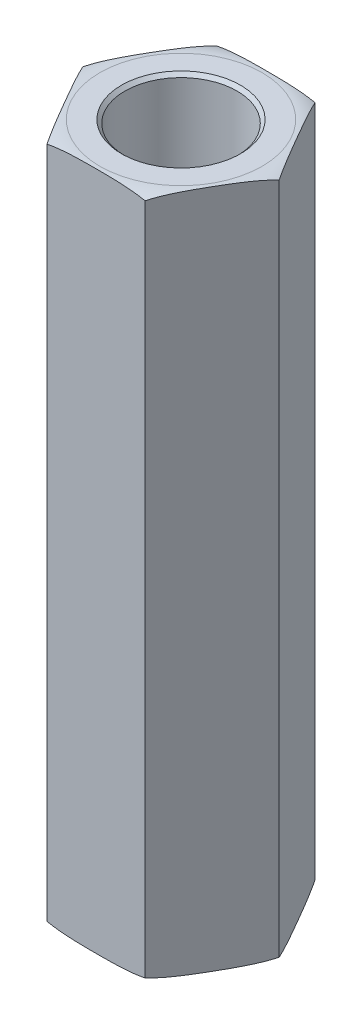
ISO-10303-21;
HEADER;
FILE_DESCRIPTION(('STEP AP214'),'2;1');
FILE_NAME('part.step','',(''),(''),'','','');
FILE_SCHEMA(('AUTOMOTIVE_DESIGN { 1 0 10303 214 1 1 1 1 }'));
ENDSEC;
DATA;
#1=APPLICATION_CONTEXT('core data for automotive mechanical design processes');
#2=APPLICATION_PROTOCOL_DEFINITION('international standard','automotive_design',2000,#1);
#3=PRODUCT_CONTEXT('',#1,'mechanical');
#4=PRODUCT('Part','Part','',(#3));
#5=PRODUCT_RELATED_PRODUCT_CATEGORY('part','',(#4));
#6=PRODUCT_DEFINITION_FORMATION('','',#4);
#7=PRODUCT_DEFINITION_CONTEXT('part definition',#1,'design');
#8=PRODUCT_DEFINITION('design','',#6,#7);
#9=PRODUCT_DEFINITION_SHAPE('','',#8);
#10=(LENGTH_UNIT() NAMED_UNIT(*) SI_UNIT(.MILLI.,.METRE.));
#11=(NAMED_UNIT(*) PLANE_ANGLE_UNIT() SI_UNIT($,.RADIAN.));
#12=(NAMED_UNIT(*) SI_UNIT($,.STERADIAN.) SOLID_ANGLE_UNIT());
#13=UNCERTAINTY_MEASURE_WITH_UNIT(LENGTH_MEASURE(1.E-05),#10,'distance_accuracy_value','');
#14=(GEOMETRIC_REPRESENTATION_CONTEXT(3) GLOBAL_UNCERTAINTY_ASSIGNED_CONTEXT((#13)) GLOBAL_UNIT_ASSIGNED_CONTEXT((#10,
#11,#12)) REPRESENTATION_CONTEXT('',''));
#15=CARTESIAN_POINT('',(0.,0.,0.));
#16=DIRECTION('',(0.,0.,1.));
#17=DIRECTION('',(1.,0.,0.));
#18=AXIS2_PLACEMENT_3D('',#15,#16,#17);
#19=CARTESIAN_POINT('',(3.66617420935412,12.7,0.));
#20=DIRECTION('',(-0.866025403784439,0.,0.5));
#21=DIRECTION('',(0.5,0.,0.866025403784439));
#22=AXIS2_PLACEMENT_3D('',#19,#20,#21);
#23=PLANE('',#22);
#24=DIRECTION('',(0.,1.,0.));
#25=VECTOR('',#24,1.);
#26=CARTESIAN_POINT('',(1.83308710467704,12.7,-3.175));
#27=LINE('',#26,#25);
#28=CARTESIAN_POINT('',(1.83308710467705,-12.573,-3.175));
#29=VERTEX_POINT('',#28);
#30=CARTESIAN_POINT('',(1.83308710467706,12.573,-3.175));
#31=VERTEX_POINT('',#30);
#32=EDGE_CURVE('E300',#29,#31,#27,.T.);
#33=ORIENTED_EDGE('',*,*,#32,.T.);
#34=CARTESIAN_POINT('',(3.66617420935412,12.573,0.));
#35=CARTESIAN_POINT('',(3.62797961467394,12.5889014148997,-0.0661549785605592));
#36=CARTESIAN_POINT('',(3.58956810864157,12.6024886076105,-0.132685658603878));
#37=CARTESIAN_POINT('',(3.5124905179571,12.6258161979402,-0.266187961794366));
#38=CARTESIAN_POINT('',(3.47382473049846,12.6355604771397,-0.3331590701874));
#39=CARTESIAN_POINT('',(3.39641631867872,12.6519966530451,-0.467234372392396));
#40=CARTESIAN_POINT('',(3.35767399633311,12.6586945328669,-0.534338043098201));
#41=CARTESIAN_POINT('',(3.28009834620112,12.6697767572932,-0.668703010557003));
#42=CARTESIAN_POINT('',(3.2412649958777,12.674160450474,-0.735964346345293));
#43=CARTESIAN_POINT('',(3.16354065964313,12.6812403004263,-0.870586845688127));
#44=CARTESIAN_POINT('',(3.12464965374474,12.6839355237591,-0.937948043861601));
#45=CARTESIAN_POINT('',(3.04685144594591,12.6881531983713,-1.07269849250698));
#46=CARTESIAN_POINT('',(3.00794424351967,12.6896756080272,-1.14008774388959));
#47=CARTESIAN_POINT('',(2.9305151759887,12.691922705889,-1.2741988228359));
#48=CARTESIAN_POINT('',(2.89199336248932,12.6926552468181,-1.34092056101654));
#49=CARTESIAN_POINT('',(2.81494778346141,12.6935767302574,-1.47436741839144));
#50=CARTESIAN_POINT('',(2.77642401791436,12.6937656658949,-1.5410925376178));
#51=CARTESIAN_POINT('',(2.69935964431009,12.6936659966806,-1.67457194815386));
#52=CARTESIAN_POINT('',(2.66081903631818,12.6933771811766,-1.74132623935045));
#53=CARTESIAN_POINT('',(2.58373908085326,12.692221986219,-1.87483263846084));
#54=CARTESIAN_POINT('',(2.54519973341241,12.6913555970386,-1.94158474631893));
#55=CARTESIAN_POINT('',(2.46812969629766,12.6887861940656,-2.0750739663429));
#56=CARTESIAN_POINT('',(2.42959900625961,12.6870832271617,-2.1418110791395));
#57=CARTESIAN_POINT('',(2.35255651340904,12.6824387229726,-2.27525259109845));
#58=CARTESIAN_POINT('',(2.31404470975438,12.6794972471358,-2.34195699171943));
#59=CARTESIAN_POINT('',(2.2508420623994,12.6732174124749,-2.45142718811111));
#60=CARTESIAN_POINT('',(2.22613849337005,12.6703980110463,-2.49421502479823));
#61=CARTESIAN_POINT('',(2.17676945272224,12.6638696794304,-2.57972471152118));
#62=CARTESIAN_POINT('',(2.1521039703418,12.6601610809139,-2.6224465801973));
#63=CARTESIAN_POINT('',(2.10282753811693,12.6516802711497,-2.7077958644265));
#64=CARTESIAN_POINT('',(2.07821657107526,12.6469084657008,-2.75042330976607));
#65=CARTESIAN_POINT('',(2.02900094683547,12.6360987712516,-2.8356672714756));
#66=CARTESIAN_POINT('',(2.00439646085461,12.6300577313084,-2.87828349128856));
#67=CARTESIAN_POINT('',(1.95527325900932,12.6165138354161,-2.96336737271507));
#68=CARTESIAN_POINT('',(1.93075459617613,12.609010197803,-3.00583494247581));
#69=CARTESIAN_POINT('',(1.8818215737317,12.5923203507084,-3.09058942351746));
#70=CARTESIAN_POINT('',(1.85740744053269,12.5831314978033,-3.13287594264091));
#71=CARTESIAN_POINT('',(1.83308710467706,12.573,-3.175));
#72=B_SPLINE_CURVE_WITH_KNOTS('',3,(#34,#35,#36,#37,#38,#39,#40,#41,#42,#43,#44,#45,#46,#47,#48,
#49,#50,#51,#52,#53,#54,#55,#56,#57,#58,#59,#60,#61,#62,#63,#64,#65,#66,#67,#68,#69,#70,#71),
.UNSPECIFIED.,.F.,.F.,(4,2,2,2,2,2,2,2,2,2,2,2,2,2,2,2,2,2,4),(0.,0.233977307817949,
0.467717675040708,0.700996973557522,0.934341903229779,1.16781571967243,1.40129782179829,
1.63243665809675,1.86357841666623,2.09482211846301,2.32606971471502,2.55730435147406,
2.78852751694422,2.93698369265095,3.0853845800448,3.23372892334589,3.38244598546616,
3.53124274626086,3.68027493713585),.UNSPECIFIED.);
#73=CARTESIAN_POINT('',(3.66617420935412,12.573,0.));
#74=VERTEX_POINT('',#73);
#75=EDGE_CURVE('E94',#74,#31,#72,.T.);
#76=ORIENTED_EDGE('',*,*,#75,.F.);
#77=DIRECTION('',(0.,1.,0.));
#78=VECTOR('',#77,1.);
#79=CARTESIAN_POINT('',(3.66617420935412,12.7,0.));
#80=LINE('',#79,#78);
#81=CARTESIAN_POINT('',(3.66617420935412,-12.573,0.));
#82=VERTEX_POINT('',#81);
#83=EDGE_CURVE('E297',#74,#82,#80,.F.);
#84=ORIENTED_EDGE('',*,*,#83,.T.);
#85=CARTESIAN_POINT('',(1.83308710467705,-12.573,-3.17500000000001));
#86=CARTESIAN_POINT('',(1.87128169935723,-12.5889014148997,-3.10884502143945));
#87=CARTESIAN_POINT('',(1.9096932053896,-12.6024886076105,-3.04231434139613));
#88=CARTESIAN_POINT('',(1.98677079607407,-12.6258161979402,-2.90881203820565));
#89=CARTESIAN_POINT('',(2.02543658353271,-12.6355604771397,-2.84184092981261));
#90=CARTESIAN_POINT('',(2.10284499535244,-12.6519966530451,-2.70776562760762));
#91=CARTESIAN_POINT('',(2.14158731769805,-12.6586945328669,-2.64066195690182));
#92=CARTESIAN_POINT('',(2.21916296783004,-12.6697767572932,-2.50629698944302));
#93=CARTESIAN_POINT('',(2.25799631815347,-12.674160450474,-2.43903565365473));
#94=CARTESIAN_POINT('',(2.33572065438803,-12.6812403004263,-2.3044131543119));
#95=CARTESIAN_POINT('',(2.37461166028642,-12.6839355237591,-2.23705195613842));
#96=CARTESIAN_POINT('',(2.45240986808525,-12.6881531983713,-2.10230150749305));
#97=CARTESIAN_POINT('',(2.49131707051149,-12.6896756080272,-2.03491225611044));
#98=CARTESIAN_POINT('',(2.56874613804245,-12.691922705889,-1.90080117716413));
#99=CARTESIAN_POINT('',(2.60726795154184,-12.6926552468181,-1.8340794389835));
#100=CARTESIAN_POINT('',(2.68431353056975,-12.6935767302574,-1.70063258160859));
#101=CARTESIAN_POINT('',(2.72283729611679,-12.6937656658949,-1.63390746238224));
#102=CARTESIAN_POINT('',(2.79990166972106,-12.6936659966806,-1.50042805184618));
#103=CARTESIAN_POINT('',(2.83844227771297,-12.6933771811766,-1.43367376064959));
#104=CARTESIAN_POINT('',(2.91552223317789,-12.692221986219,-1.30016736153921));
#105=CARTESIAN_POINT('',(2.95406158061874,-12.6913555970386,-1.23341525368111));
#106=CARTESIAN_POINT('',(3.03113161773348,-12.6887861940656,-1.09992603365715));
#107=CARTESIAN_POINT('',(3.06966230777154,-12.6870832271617,-1.03318892086055));
#108=CARTESIAN_POINT('',(3.14670480062211,-12.6824387229726,-0.899747408901607));
#109=CARTESIAN_POINT('',(3.18521660427677,-12.6794972471358,-0.833043008280621));
#110=CARTESIAN_POINT('',(3.24841925163175,-12.6732174124749,-0.723572811888938));
#111=CARTESIAN_POINT('',(3.27312282066109,-12.6703980110463,-0.680784975201824));
#112=CARTESIAN_POINT('',(3.32249186130891,-12.6638696794304,-0.595275288478867));
#113=CARTESIAN_POINT('',(3.34715734368935,-12.6601610809139,-0.552553419802744));
#114=CARTESIAN_POINT('',(3.39643377591423,-12.6516802711497,-0.467204135573539));
#115=CARTESIAN_POINT('',(3.4210447429559,-12.6469084657008,-0.424576690233965));
#116=CARTESIAN_POINT('',(3.47026036719569,-12.6360987712516,-0.339332728524428));
#117=CARTESIAN_POINT('',(3.49486485317655,-12.6300577313084,-0.296716508711459));
#118=CARTESIAN_POINT('',(3.54398805502185,-12.6165138354161,-0.211632627284942));
#119=CARTESIAN_POINT('',(3.56850671785504,-12.609010197803,-0.169165057524202));
#120=CARTESIAN_POINT('',(3.61743974029947,-12.5923203507084,-0.0844105764825456));
#121=CARTESIAN_POINT('',(3.64185387349848,-12.5831314978033,-0.0421240573590982));
#122=CARTESIAN_POINT('',(3.66617420935412,-12.573,0.));
#123=B_SPLINE_CURVE_WITH_KNOTS('',3,(#85,#86,#87,#88,#89,#90,#91,#92,#93,#94,#95,#96,#97,#98,
#99,#100,#101,#102,#103,#104,#105,#106,#107,#108,#109,#110,#111,#112,#113,#114,#115,#116,#117,
#118,#119,#120,#121,#122),.UNSPECIFIED.,.F.,.F.,(4,2,2,2,2,2,2,2,2,2,2,2,2,2,2,2,2,2,4),(0.,
0.233977307817944,0.467717675040699,0.700996973557508,0.934341903229761,1.16781571967241,
1.40129782179826,1.63243665809671,1.86357841666619,2.09482211846297,2.32606971471497,
2.55730435147401,2.78852751694416,2.9369836926509,3.08538458004476,3.23372892334587,
3.38244598546614,3.53124274626085,3.68027493713586),.UNSPECIFIED.);
#124=EDGE_CURVE('E143',#29,#82,#123,.T.);
#125=ORIENTED_EDGE('',*,*,#124,.F.);
#126=EDGE_LOOP('',(#33,#76,#84,#125));
#127=FACE_BOUND('',#126,.T.);
#128=ADVANCED_FACE('F14',(#127),#23,.F.);
#129=CARTESIAN_POINT('',(1.83308710467706,12.7,3.17499999999999));
#130=DIRECTION('',(-0.866025403784439,0.,-0.5));
#131=DIRECTION('',(-0.5,0.,0.866025403784439));
#132=AXIS2_PLACEMENT_3D('',#129,#130,#131);
#133=PLANE('',#132);
#134=ORIENTED_EDGE('',*,*,#83,.F.);
#135=CARTESIAN_POINT('',(1.83308710467706,12.573,3.17499999999999));
#136=CARTESIAN_POINT('',(1.87128169935724,12.5889014148997,3.10884502143943));
#137=CARTESIAN_POINT('',(1.90969320538962,12.6024886076105,3.04231434139611));
#138=CARTESIAN_POINT('',(1.98677079607408,12.6258161979402,2.90881203820562));
#139=CARTESIAN_POINT('',(2.02543658353273,12.6355604771397,2.84184092981259));
#140=CARTESIAN_POINT('',(2.10284499535246,12.6519966530451,2.7077656276076));
#141=CARTESIAN_POINT('',(2.14158731769807,12.6586945328669,2.64066195690179));
#142=CARTESIAN_POINT('',(2.21916296783006,12.6697767572932,2.50629698944299));
#143=CARTESIAN_POINT('',(2.25799631815349,12.674160450474,2.4390356536547));
#144=CARTESIAN_POINT('',(2.33572065438805,12.6812403004263,2.30441315431186));
#145=CARTESIAN_POINT('',(2.37461166028644,12.6839355237591,2.23705195613839));
#146=CARTESIAN_POINT('',(2.45240986808528,12.6881531983713,2.10230150749301));
#147=CARTESIAN_POINT('',(2.49131707051151,12.6896756080272,2.0349122561104));
#148=CARTESIAN_POINT('',(2.56874613804248,12.691922705889,1.90080117716409));
#149=CARTESIAN_POINT('',(2.60726795154187,12.6926552468181,1.83407943898345));
#150=CARTESIAN_POINT('',(2.68431353056978,12.6935767302574,1.70063258160855));
#151=CARTESIAN_POINT('',(2.72283729611682,12.6937656658949,1.63390746238219));
#152=CARTESIAN_POINT('',(2.79990166972109,12.6936659966806,1.50042805184613));
#153=CARTESIAN_POINT('',(2.83844227771301,12.6933771811766,1.43367376064954));
#154=CARTESIAN_POINT('',(2.91552223317792,12.692221986219,1.30016736153915));
#155=CARTESIAN_POINT('',(2.95406158061877,12.6913555970386,1.23341525368106));
#156=CARTESIAN_POINT('',(3.03113161773352,12.6887861940656,1.09992603365709));
#157=CARTESIAN_POINT('',(3.06966230777158,12.6870832271617,1.03318892086049));
#158=CARTESIAN_POINT('',(3.14670480062214,12.6824387229726,0.899747408901544));
#159=CARTESIAN_POINT('',(3.1852166042768,12.6794972471358,0.833043008280556));
#160=CARTESIAN_POINT('',(3.24841925163178,12.6732174124749,0.723572811888876));
#161=CARTESIAN_POINT('',(3.27312282066113,12.6703980110463,0.680784975201767));
#162=CARTESIAN_POINT('',(3.32249186130894,12.6638696794304,0.595275288478818));
#163=CARTESIAN_POINT('',(3.34715734368938,12.6601610809139,0.552553419802699));
#164=CARTESIAN_POINT('',(3.39643377591425,12.6516802711497,0.467204135573501));
#165=CARTESIAN_POINT('',(3.42104474295592,12.6469084657008,0.424576690233932));
#166=CARTESIAN_POINT('',(3.47026036719571,12.6360987712516,0.339332728524402));
#167=CARTESIAN_POINT('',(3.49486485317657,12.6300577313084,0.296716508711437));
#168=CARTESIAN_POINT('',(3.54398805502186,12.6165138354161,0.211632627284927));
#169=CARTESIAN_POINT('',(3.56850671785505,12.609010197803,0.169165057524192));
#170=CARTESIAN_POINT('',(3.61743974029947,12.5923203507084,0.0844105764825436));
#171=CARTESIAN_POINT('',(3.64185387349848,12.5831314978033,0.0421240573591002));
#172=CARTESIAN_POINT('',(3.66617420935412,12.573,0.));
#173=B_SPLINE_CURVE_WITH_KNOTS('',3,(#135,#136,#137,#138,#139,#140,#141,#142,#143,#144,#145,
#146,#147,#148,#149,#150,#151,#152,#153,#154,#155,#156,#157,#158,#159,#160,#161,#162,#163,#164,
#165,#166,#167,#168,#169,#170,#171,#172),.UNSPECIFIED.,.F.,.F.,(4,2,2,2,2,2,2,2,2,2,2,2,2,2,2,2,
2,2,4),(0.,0.23397730781795,0.467717675040709,0.700996973557522,0.93434190322978,
1.16781571967243,1.40129782179829,1.63243665809675,1.86357841666623,2.09482211846301,
2.32606971471502,2.55730435147406,2.78852751694422,2.93698369265095,3.08538458004479,
3.23372892334589,3.38244598546615,3.53124274626085,3.68027493713584),.UNSPECIFIED.);
#174=CARTESIAN_POINT('',(1.83308710467706,12.573,3.17499999999999));
#175=VERTEX_POINT('',#174);
#176=EDGE_CURVE('E171',#175,#74,#173,.T.);
#177=ORIENTED_EDGE('',*,*,#176,.F.);
#178=DIRECTION('',(0.,1.,0.));
#179=VECTOR('',#178,1.);
#180=CARTESIAN_POINT('',(1.83308710467706,12.7,3.17499999999999));
#181=LINE('',#180,#179);
#182=CARTESIAN_POINT('',(1.83308710467706,-12.573,3.17499999999999));
#183=VERTEX_POINT('',#182);
#184=EDGE_CURVE('E295',#175,#183,#181,.F.);
#185=ORIENTED_EDGE('',*,*,#184,.T.);
#186=CARTESIAN_POINT('',(3.66617420935412,-12.573,0.));
#187=CARTESIAN_POINT('',(3.62797961467394,-12.5889014148997,0.0661549785605638));
#188=CARTESIAN_POINT('',(3.58956810864156,-12.6024886076105,0.132685658603883));
#189=CARTESIAN_POINT('',(3.5124905179571,-12.6258161979402,0.266187961794371));
#190=CARTESIAN_POINT('',(3.47382473049846,-12.6355604771397,0.333159070187405));
#191=CARTESIAN_POINT('',(3.39641631867872,-12.6519966530451,0.467234372392401));
#192=CARTESIAN_POINT('',(3.35767399633311,-12.6586945328669,0.534338043098206));
#193=CARTESIAN_POINT('',(3.28009834620112,-12.6697767572932,0.668703010557008));
#194=CARTESIAN_POINT('',(3.2412649958777,-12.674160450474,0.735964346345298));
#195=CARTESIAN_POINT('',(3.16354065964313,-12.6812403004263,0.870586845688132));
#196=CARTESIAN_POINT('',(3.12464965374474,-12.6839355237591,0.937948043861606));
#197=CARTESIAN_POINT('',(3.0468514459459,-12.6881531983713,1.07269849250699));
#198=CARTESIAN_POINT('',(3.00794424351967,-12.6896756080272,1.1400877438896));
#199=CARTESIAN_POINT('',(2.9305151759887,-12.691922705889,1.27419882283591));
#200=CARTESIAN_POINT('',(2.89199336248931,-12.6926552468181,1.34092056101654));
#201=CARTESIAN_POINT('',(2.8149477834614,-12.6935767302574,1.47436741839145));
#202=CARTESIAN_POINT('',(2.77642401791436,-12.6937656658949,1.5410925376178));
#203=CARTESIAN_POINT('',(2.69935964431009,-12.6936659966806,1.67457194815387));
#204=CARTESIAN_POINT('',(2.66081903631818,-12.6933771811766,1.74132623935046));
#205=CARTESIAN_POINT('',(2.58373908085326,-12.692221986219,1.87483263846084));
#206=CARTESIAN_POINT('',(2.54519973341241,-12.6913555970386,1.94158474631894));
#207=CARTESIAN_POINT('',(2.46812969629766,-12.6887861940656,2.0750739663429));
#208=CARTESIAN_POINT('',(2.4295990062596,-12.6870832271616,2.14181107913951));
#209=CARTESIAN_POINT('',(2.35255651340904,-12.6824387229726,2.27525259109845));
#210=CARTESIAN_POINT('',(2.31404470975437,-12.6794972471358,2.34195699171944));
#211=CARTESIAN_POINT('',(2.2508420623994,-12.6732174124749,2.45142718811112));
#212=CARTESIAN_POINT('',(2.22613849337005,-12.6703980110463,2.49421502479823));
#213=CARTESIAN_POINT('',(2.17676945272224,-12.6638696794304,2.57972471152118));
#214=CARTESIAN_POINT('',(2.1521039703418,-12.6601610809139,2.6224465801973));
#215=CARTESIAN_POINT('',(2.10282753811693,-12.6516802711497,2.7077958644265));
#216=CARTESIAN_POINT('',(2.07821657107526,-12.6469084657008,2.75042330976606));
#217=CARTESIAN_POINT('',(2.02900094683548,-12.6360987712516,2.83566727147559));
#218=CARTESIAN_POINT('',(2.00439646085462,-12.6300577313084,2.87828349128856));
#219=CARTESIAN_POINT('',(1.95527325900932,-12.6165138354161,2.96336737271507));
#220=CARTESIAN_POINT('',(1.93075459617613,-12.609010197803,3.0058349424758));
#221=CARTESIAN_POINT('',(1.88182157373171,-12.5923203507084,3.09058942351745));
#222=CARTESIAN_POINT('',(1.8574074405327,-12.5831314978033,3.1328759426409));
#223=CARTESIAN_POINT('',(1.83308710467706,-12.573,3.17499999999999));
#224=B_SPLINE_CURVE_WITH_KNOTS('',3,(#186,#187,#188,#189,#190,#191,#192,#193,#194,#195,#196,
#197,#198,#199,#200,#201,#202,#203,#204,#205,#206,#207,#208,#209,#210,#211,#212,#213,#214,#215,
#216,#217,#218,#219,#220,#221,#222,#223),.UNSPECIFIED.,.F.,.F.,(4,2,2,2,2,2,2,2,2,2,2,2,2,2,2,2,
2,2,4),(0.,0.233977307817949,0.467717675040709,0.700996973557522,0.93434190322978,
1.16781571967243,1.40129782179829,1.63243665809675,1.86357841666623,2.09482211846301,
2.32606971471502,2.55730435147406,2.78852751694422,2.93698369265095,3.08538458004479,
3.23372892334589,3.38244598546615,3.53124274626085,3.68027493713584),.UNSPECIFIED.);
#225=EDGE_CURVE('E150',#82,#183,#224,.T.);
#226=ORIENTED_EDGE('',*,*,#225,.F.);
#227=EDGE_LOOP('',(#134,#177,#185,#226));
#228=FACE_BOUND('',#227,.T.);
#229=ADVANCED_FACE('F162',(#228),#133,.F.);
#230=CARTESIAN_POINT('',(1.83308710467706,12.7,-3.175));
#231=DIRECTION('',(0.,0.,1.));
#232=DIRECTION('',(1.,0.,0.));
#233=AXIS2_PLACEMENT_3D('',#230,#231,#232);
#234=PLANE('',#233);
#235=DIRECTION('',(0.,1.,0.));
#236=VECTOR('',#235,1.);
#237=CARTESIAN_POINT('',(-1.83308710467707,12.7,-3.175));
#238=LINE('',#237,#236);
#239=CARTESIAN_POINT('',(-1.83308710467707,-12.573,-3.175));
#240=VERTEX_POINT('',#239);
#241=CARTESIAN_POINT('',(-1.83308710467706,12.573,-3.17500000000001));
#242=VERTEX_POINT('',#241);
#243=EDGE_CURVE('E101',#240,#242,#238,.T.);
#244=ORIENTED_EDGE('',*,*,#243,.T.);
#245=CARTESIAN_POINT('',(1.83308710467705,12.573,-3.175));
#246=CARTESIAN_POINT('',(1.73237579828683,12.5939400141518,-3.175));
#247=CARTESIAN_POINT('',(1.63096506893486,12.6108853495327,-3.175));
#248=CARTESIAN_POINT('',(1.42767146651469,12.6384971643984,-3.175));
#249=CARTESIAN_POINT('',(1.32579191427254,12.6491875658753,-3.175));
#250=CARTESIAN_POINT('',(1.12177634709137,12.6661280408079,-3.175));
#251=CARTESIAN_POINT('',(1.01964056643379,12.6723812707189,-3.175));
#252=CARTESIAN_POINT('',(0.815663681397375,12.6819028064183,-3.175));
#253=CARTESIAN_POINT('',(0.713823115514572,12.6851834044999,-3.175));
#254=CARTESIAN_POINT('',(0.51001848544165,12.6899454848703,-3.175));
#255=CARTESIAN_POINT('',(0.408054390577976,12.6914254100882,-3.175));
#256=CARTESIAN_POINT('',(0.20406020033787,12.6933146818379,-3.175));
#257=CARTESIAN_POINT('',(0.102030100168935,12.6937234241492,-3.175));
#258=CARTESIAN_POINT('',(-0.102030100168934,12.6937234241492,-3.175));
#259=CARTESIAN_POINT('',(-0.204060200337869,12.6933146818379,-3.175));
#260=CARTESIAN_POINT('',(-0.408054390577975,12.6914254100882,-3.175));
#261=CARTESIAN_POINT('',(-0.510018485441649,12.6899454848703,-3.175));
#262=CARTESIAN_POINT('',(-0.71382311551457,12.6851834044999,-3.175));
#263=CARTESIAN_POINT('',(-0.815663681397372,12.6819028064183,-3.175));
#264=CARTESIAN_POINT('',(-1.01964056643379,12.6723812707189,-3.175));
#265=CARTESIAN_POINT('',(-1.12177634709137,12.6661280408079,-3.175));
#266=CARTESIAN_POINT('',(-1.32579191427253,12.6491875658753,-3.175));
#267=CARTESIAN_POINT('',(-1.42767146651468,12.6384971643984,-3.175));
#268=CARTESIAN_POINT('',(-1.63096506893485,12.6108853495327,-3.175));
#269=CARTESIAN_POINT('',(-1.73237579828682,12.5939400141518,-3.175));
#270=CARTESIAN_POINT('',(-1.83308710467705,12.573,-3.175));
#271=B_SPLINE_CURVE_WITH_KNOTS('',3,(#245,#246,#247,#248,#249,#250,#251,#252,#253,#254,#255,
#256,#257,#258,#259,#260,#261,#262,#263,#264,#265,#266,#267,#268,#269,#270),.UNSPECIFIED.,.F.,
.F.,(4,2,2,2,2,2,2,2,2,2,2,2,4),(0.,0.308333242342807,0.615479423308234,0.922406891130007,
1.2280592962085,1.53397581645216,1.84006485747888,2.14615389850561,2.45207041874927,
2.75772282382776,3.06465029164953,3.37179647261496,3.68012971495776),.UNSPECIFIED.);
#272=EDGE_CURVE('E86',#31,#242,#271,.T.);
#273=ORIENTED_EDGE('',*,*,#272,.F.);
#274=ORIENTED_EDGE('',*,*,#32,.F.);
#275=CARTESIAN_POINT('',(-1.83308710467707,-12.573,-3.175));
#276=CARTESIAN_POINT('',(-1.73237579828684,-12.5939400141518,-3.175));
#277=CARTESIAN_POINT('',(-1.63096506893487,-12.6108853495327,-3.175));
#278=CARTESIAN_POINT('',(-1.4276714665147,-12.6384971643984,-3.175));
#279=CARTESIAN_POINT('',(-1.32579191427255,-12.6491875658753,-3.175));
#280=CARTESIAN_POINT('',(-1.12177634709138,-12.6661280408079,-3.175));
#281=CARTESIAN_POINT('',(-1.0196405664338,-12.6723812707189,-3.175));
#282=CARTESIAN_POINT('',(-0.81566368139738,-12.6819028064183,-3.175));
#283=CARTESIAN_POINT('',(-0.713823115514577,-12.6851834044999,-3.175));
#284=CARTESIAN_POINT('',(-0.510018485441654,-12.6899454848703,-3.175));
#285=CARTESIAN_POINT('',(-0.408054390577979,-12.6914254100882,-3.175));
#286=CARTESIAN_POINT('',(-0.204060200337872,-12.6933146818379,-3.175));
#287=CARTESIAN_POINT('',(-0.102030100168936,-12.6937234241492,-3.175));
#288=CARTESIAN_POINT('',(0.102030100168934,-12.6937234241492,-3.175));
#289=CARTESIAN_POINT('',(0.204060200337868,-12.6933146818379,-3.175));
#290=CARTESIAN_POINT('',(0.408054390577973,-12.6914254100882,-3.175));
#291=CARTESIAN_POINT('',(0.510018485441647,-12.6899454848703,-3.175));
#292=CARTESIAN_POINT('',(0.713823115514568,-12.6851834044999,-3.175));
#293=CARTESIAN_POINT('',(0.81566368139737,-12.6819028064183,-3.175));
#294=CARTESIAN_POINT('',(1.01964056643379,-12.6723812707189,-3.175));
#295=CARTESIAN_POINT('',(1.12177634709137,-12.6661280408079,-3.175));
#296=CARTESIAN_POINT('',(1.32579191427253,-12.6491875658753,-3.175));
#297=CARTESIAN_POINT('',(1.42767146651468,-12.6384971643984,-3.175));
#298=CARTESIAN_POINT('',(1.63096506893485,-12.6108853495327,-3.175));
#299=CARTESIAN_POINT('',(1.73237579828682,-12.5939400141518,-3.175));
#300=CARTESIAN_POINT('',(1.83308710467704,-12.573,-3.175));
#301=B_SPLINE_CURVE_WITH_KNOTS('',3,(#275,#276,#277,#278,#279,#280,#281,#282,#283,#284,#285,
#286,#287,#288,#289,#290,#291,#292,#293,#294,#295,#296,#297,#298,#299,#300),.UNSPECIFIED.,.F.,
.F.,(4,2,2,2,2,2,2,2,2,2,2,2,4),(0.,0.308333242342809,0.615479423308238,0.922406891130013,
1.22805929620851,1.53397581645217,1.8400648574789,2.14615389850562,2.45207041874928,
2.75772282382777,3.06465029164954,3.37179647261496,3.68012971495777),.UNSPECIFIED.);
#302=EDGE_CURVE('E103',#240,#29,#301,.T.);
#303=ORIENTED_EDGE('',*,*,#302,.F.);
#304=EDGE_LOOP('',(#244,#273,#274,#303));
#305=FACE_BOUND('',#304,.T.);
#306=ADVANCED_FACE('F102',(#305),#234,.F.);
#307=CARTESIAN_POINT('',(-1.83308710467707,12.7,3.175));
#308=DIRECTION('',(0.,0.,-1.));
#309=DIRECTION('',(-1.,0.,0.));
#310=AXIS2_PLACEMENT_3D('',#307,#308,#309);
#311=PLANE('',#310);
#312=ORIENTED_EDGE('',*,*,#184,.F.);
#313=CARTESIAN_POINT('',(-1.83308710467706,12.573,3.175));
#314=CARTESIAN_POINT('',(-1.73237579828684,12.5939400141518,3.175));
#315=CARTESIAN_POINT('',(-1.63096506893486,12.6108853495327,3.175));
#316=CARTESIAN_POINT('',(-1.42767146651469,12.6384971643984,3.175));
#317=CARTESIAN_POINT('',(-1.32579191427254,12.6491875658753,3.175));
#318=CARTESIAN_POINT('',(-1.12177634709138,12.6661280408079,3.175));
#319=CARTESIAN_POINT('',(-1.0196405664338,12.6723812707189,3.175));
#320=CARTESIAN_POINT('',(-0.815663681397378,12.6819028064183,3.175));
#321=CARTESIAN_POINT('',(-0.713823115514575,12.6851834044999,3.175));
#322=CARTESIAN_POINT('',(-0.510018485441652,12.6899454848703,3.175));
#323=CARTESIAN_POINT('',(-0.408054390577977,12.6914254100882,3.175));
#324=CARTESIAN_POINT('',(-0.204060200337871,12.6933146818379,3.175));
#325=CARTESIAN_POINT('',(-0.102030100168935,12.6937234241492,3.17499999999999));
#326=CARTESIAN_POINT('',(0.102030100168935,12.6937234241492,3.17499999999999));
#327=CARTESIAN_POINT('',(0.204060200337871,12.6933146818379,3.17499999999999));
#328=CARTESIAN_POINT('',(0.408054390577978,12.6914254100882,3.17499999999999));
#329=CARTESIAN_POINT('',(0.510018485441652,12.6899454848703,3.17499999999999));
#330=CARTESIAN_POINT('',(0.713823115514575,12.6851834044999,3.17499999999999));
#331=CARTESIAN_POINT('',(0.815663681397378,12.6819028064183,3.17499999999999));
#332=CARTESIAN_POINT('',(1.0196405664338,12.6723812707189,3.17499999999999));
#333=CARTESIAN_POINT('',(1.12177634709138,12.6661280408079,3.17499999999999));
#334=CARTESIAN_POINT('',(1.32579191427254,12.6491875658753,3.17499999999999));
#335=CARTESIAN_POINT('',(1.42767146651469,12.6384971643984,3.17499999999999));
#336=CARTESIAN_POINT('',(1.63096506893486,12.6108853495327,3.17499999999999));
#337=CARTESIAN_POINT('',(1.73237579828684,12.5939400141518,3.17499999999999));
#338=CARTESIAN_POINT('',(1.83308710467706,12.573,3.17499999999999));
#339=B_SPLINE_CURVE_WITH_KNOTS('',3,(#313,#314,#315,#316,#317,#318,#319,#320,#321,#322,#323,
#324,#325,#326,#327,#328,#329,#330,#331,#332,#333,#334,#335,#336,#337,#338),.UNSPECIFIED.,.F.,
.F.,(4,2,2,2,2,2,2,2,2,2,2,2,4),(0.,0.308333242342808,0.615479423308237,0.922406891130011,
1.2280592962085,1.53397581645216,1.84006485747889,2.14615389850562,2.45207041874928,
2.75772282382777,3.06465029164955,3.37179647261498,3.68012971495778),.UNSPECIFIED.);
#340=CARTESIAN_POINT('',(-1.83308710467707,12.573,3.175));
#341=VERTEX_POINT('',#340);
#342=EDGE_CURVE('E97',#341,#175,#339,.T.);
#343=ORIENTED_EDGE('',*,*,#342,.F.);
#344=DIRECTION('',(0.,1.,0.));
#345=VECTOR('',#344,1.);
#346=CARTESIAN_POINT('',(-1.83308710467707,12.7,3.175));
#347=LINE('',#346,#345);
#348=CARTESIAN_POINT('',(-1.83308710467706,-12.573,3.175));
#349=VERTEX_POINT('',#348);
#350=EDGE_CURVE('E105',#341,#349,#347,.F.);
#351=ORIENTED_EDGE('',*,*,#350,.T.);
#352=CARTESIAN_POINT('',(1.83308710467706,-12.573,3.17499999999999));
#353=CARTESIAN_POINT('',(1.73237579828684,-12.5939400141518,3.17499999999999));
#354=CARTESIAN_POINT('',(1.63096506893486,-12.6108853495327,3.17499999999999));
#355=CARTESIAN_POINT('',(1.4276714665147,-12.6384971643984,3.17499999999999));
#356=CARTESIAN_POINT('',(1.32579191427254,-12.6491875658753,3.17499999999999));
#357=CARTESIAN_POINT('',(1.12177634709138,-12.6661280408079,3.17499999999999));
#358=CARTESIAN_POINT('',(1.0196405664338,-12.6723812707189,3.17499999999999));
#359=CARTESIAN_POINT('',(0.815663681397379,-12.6819028064183,3.17499999999999));
#360=CARTESIAN_POINT('',(0.713823115514576,-12.6851834044999,3.17499999999999));
#361=CARTESIAN_POINT('',(0.510018485441653,-12.6899454848703,3.17499999999999));
#362=CARTESIAN_POINT('',(0.408054390577978,-12.6914254100882,3.17499999999999));
#363=CARTESIAN_POINT('',(0.204060200337871,-12.6933146818379,3.17499999999999));
#364=CARTESIAN_POINT('',(0.102030100168935,-12.6937234241492,3.17499999999999));
#365=CARTESIAN_POINT('',(-0.102030100168935,-12.6937234241492,3.17499999999999));
#366=CARTESIAN_POINT('',(-0.204060200337871,-12.6933146818379,3.175));
#367=CARTESIAN_POINT('',(-0.408054390577977,-12.6914254100882,3.175));
#368=CARTESIAN_POINT('',(-0.510018485441652,-12.6899454848703,3.175));
#369=CARTESIAN_POINT('',(-0.713823115514575,-12.6851834044999,3.175));
#370=CARTESIAN_POINT('',(-0.815663681397377,-12.6819028064183,3.175));
#371=CARTESIAN_POINT('',(-1.0196405664338,-12.6723812707189,3.175));
#372=CARTESIAN_POINT('',(-1.12177634709138,-12.6661280408079,3.175));
#373=CARTESIAN_POINT('',(-1.32579191427254,-12.6491875658753,3.175));
#374=CARTESIAN_POINT('',(-1.42767146651469,-12.6384971643984,3.175));
#375=CARTESIAN_POINT('',(-1.63096506893486,-12.6108853495327,3.175));
#376=CARTESIAN_POINT('',(-1.73237579828684,-12.5939400141518,3.175));
#377=CARTESIAN_POINT('',(-1.83308710467706,-12.573,3.175));
#378=B_SPLINE_CURVE_WITH_KNOTS('',3,(#352,#353,#354,#355,#356,#357,#358,#359,#360,#361,#362,
#363,#364,#365,#366,#367,#368,#369,#370,#371,#372,#373,#374,#375,#376,#377),.UNSPECIFIED.,.F.,
.F.,(4,2,2,2,2,2,2,2,2,2,2,2,4),(0.,0.308333242342808,0.615479423308237,0.922406891130012,
1.22805929620851,1.53397581645217,1.84006485747889,2.14615389850562,2.45207041874928,
2.75772282382777,3.06465029164955,3.37179647261498,3.68012971495779),.UNSPECIFIED.);
#379=EDGE_CURVE('E193',#183,#349,#378,.T.);
#380=ORIENTED_EDGE('',*,*,#379,.F.);
#381=EDGE_LOOP('',(#312,#343,#351,#380));
#382=FACE_BOUND('',#381,.T.);
#383=ADVANCED_FACE('F186',(#382),#311,.F.);
#384=CARTESIAN_POINT('',(-3.66617420935413,12.7,0.));
#385=DIRECTION('',(0.866025403784439,0.,-0.499999999999999));
#386=DIRECTION('',(-0.499999999999999,0.,-0.866025403784439));
#387=AXIS2_PLACEMENT_3D('',#384,#385,#386);
#388=PLANE('',#387);
#389=ORIENTED_EDGE('',*,*,#350,.F.);
#390=CARTESIAN_POINT('',(-3.66617420935412,12.573,0.));
#391=CARTESIAN_POINT('',(-3.62797961467395,12.5889014148997,0.0661549785605641));
#392=CARTESIAN_POINT('',(-3.58956810864157,12.6024886076105,0.132685658603883));
#393=CARTESIAN_POINT('',(-3.51249051795711,12.6258161979402,0.266187961794371));
#394=CARTESIAN_POINT('',(-3.47382473049846,12.6355604771397,0.333159070187405));
#395=CARTESIAN_POINT('',(-3.39641631867873,12.6519966530451,0.4672343723924));
#396=CARTESIAN_POINT('',(-3.35767399633312,12.6586945328669,0.534338043098206));
#397=CARTESIAN_POINT('',(-3.28009834620112,12.6697767572932,0.668703010557008));
#398=CARTESIAN_POINT('',(-3.2412649958777,12.674160450474,0.735964346345298));
#399=CARTESIAN_POINT('',(-3.16354065964313,12.6812403004263,0.870586845688132));
#400=CARTESIAN_POINT('',(-3.12464965374474,12.6839355237591,0.937948043861606));
#401=CARTESIAN_POINT('',(-3.04685144594591,12.6881531983713,1.07269849250699));
#402=CARTESIAN_POINT('',(-3.00794424351967,12.6896756080272,1.1400877438896));
#403=CARTESIAN_POINT('',(-2.93051517598871,12.691922705889,1.27419882283591));
#404=CARTESIAN_POINT('',(-2.89199336248932,12.6926552468181,1.34092056101654));
#405=CARTESIAN_POINT('',(-2.81494778346141,12.6935767302574,1.47436741839145));
#406=CARTESIAN_POINT('',(-2.77642401791437,12.6937656658949,1.5410925376178));
#407=CARTESIAN_POINT('',(-2.69935964431009,12.6936659966806,1.67457194815387));
#408=CARTESIAN_POINT('',(-2.66081903631818,12.6933771811766,1.74132623935046));
#409=CARTESIAN_POINT('',(-2.58373908085326,12.692221986219,1.87483263846084));
#410=CARTESIAN_POINT('',(-2.54519973341242,12.6913555970386,1.94158474631894));
#411=CARTESIAN_POINT('',(-2.46812969629767,12.6887861940656,2.0750739663429));
#412=CARTESIAN_POINT('',(-2.42959900625961,12.6870832271616,2.1418110791395));
#413=CARTESIAN_POINT('',(-2.35255651340905,12.6824387229726,2.27525259109845));
#414=CARTESIAN_POINT('',(-2.31404470975439,12.6794972471358,2.34195699171944));
#415=CARTESIAN_POINT('',(-2.25084206239941,12.6732174124749,2.45142718811112));
#416=CARTESIAN_POINT('',(-2.22613849337006,12.6703980110463,2.49421502479823));
#417=CARTESIAN_POINT('',(-2.17676945272225,12.6638696794304,2.57972471152118));
#418=CARTESIAN_POINT('',(-2.15210397034181,12.6601610809139,2.6224465801973));
#419=CARTESIAN_POINT('',(-2.10282753811694,12.6516802711497,2.7077958644265));
#420=CARTESIAN_POINT('',(-2.07821657107527,12.6469084657008,2.75042330976607));
#421=CARTESIAN_POINT('',(-2.02900094683548,12.6360987712516,2.8356672714756));
#422=CARTESIAN_POINT('',(-2.00439646085462,12.6300577313084,2.87828349128856));
#423=CARTESIAN_POINT('',(-1.95527325900933,12.6165138354161,2.96336737271507));
#424=CARTESIAN_POINT('',(-1.93075459617614,12.609010197803,3.00583494247581));
#425=CARTESIAN_POINT('',(-1.88182157373171,12.5923203507084,3.09058942351746));
#426=CARTESIAN_POINT('',(-1.8574074405327,12.5831314978033,3.1328759426409));
#427=CARTESIAN_POINT('',(-1.83308710467707,12.573,3.175));
#428=B_SPLINE_CURVE_WITH_KNOTS('',3,(#390,#391,#392,#393,#394,#395,#396,#397,#398,#399,#400,
#401,#402,#403,#404,#405,#406,#407,#408,#409,#410,#411,#412,#413,#414,#415,#416,#417,#418,#419,
#420,#421,#422,#423,#424,#425,#426,#427),.UNSPECIFIED.,.F.,.F.,(4,2,2,2,2,2,2,2,2,2,2,2,2,2,2,2,
2,2,4),(0.,0.233977307817949,0.467717675040708,0.700996973557522,0.934341903229779,
1.16781571967243,1.40129782179829,1.63243665809675,1.86357841666623,2.09482211846301,
2.32606971471502,2.55730435147406,2.78852751694422,2.93698369265094,3.08538458004479,
3.23372892334589,3.38244598546615,3.53124274626085,3.68027493713584),.UNSPECIFIED.);
#429=CARTESIAN_POINT('',(-3.66617420935413,12.573,0.));
#430=VERTEX_POINT('',#429);
#431=EDGE_CURVE('E98',#430,#341,#428,.T.);
#432=ORIENTED_EDGE('',*,*,#431,.F.);
#433=DIRECTION('',(0.,1.,0.));
#434=VECTOR('',#433,1.);
#435=CARTESIAN_POINT('',(-3.66617420935413,12.7,0.));
#436=LINE('',#435,#434);
#437=CARTESIAN_POINT('',(-3.66617420935412,-12.573,0.));
#438=VERTEX_POINT('',#437);
#439=EDGE_CURVE('E80',#430,#438,#436,.F.);
#440=ORIENTED_EDGE('',*,*,#439,.T.);
#441=CARTESIAN_POINT('',(-1.83308710467707,-12.573,3.175));
#442=CARTESIAN_POINT('',(-1.87128169935724,-12.5889014148997,3.10884502143944));
#443=CARTESIAN_POINT('',(-1.90969320538962,-12.6024886076105,3.04231434139612));
#444=CARTESIAN_POINT('',(-1.98677079607408,-12.6258161979402,2.90881203820564));
#445=CARTESIAN_POINT('',(-2.02543658353272,-12.6355604771397,2.84184092981261));
#446=CARTESIAN_POINT('',(-2.10284499535246,-12.6519966530451,2.70776562760761));
#447=CARTESIAN_POINT('',(-2.14158731769807,-12.6586945328669,2.64066195690181));
#448=CARTESIAN_POINT('',(-2.21916296783006,-12.6697767572932,2.50629698944301));
#449=CARTESIAN_POINT('',(-2.25799631815348,-12.674160450474,2.43903565365472));
#450=CARTESIAN_POINT('',(-2.33572065438804,-12.6812403004263,2.30441315431189));
#451=CARTESIAN_POINT('',(-2.37461166028644,-12.6839355237591,2.23705195613842));
#452=CARTESIAN_POINT('',(-2.45240986808527,-12.6881531983713,2.10230150749304));
#453=CARTESIAN_POINT('',(-2.4913170705115,-12.6896756080272,2.03491225611043));
#454=CARTESIAN_POINT('',(-2.56874613804247,-12.691922705889,1.90080117716412));
#455=CARTESIAN_POINT('',(-2.60726795154185,-12.6926552468181,1.83407943898349));
#456=CARTESIAN_POINT('',(-2.68431353056976,-12.6935767302574,1.70063258160858));
#457=CARTESIAN_POINT('',(-2.72283729611681,-12.6937656658949,1.63390746238223));
#458=CARTESIAN_POINT('',(-2.79990166972108,-12.6936659966806,1.50042805184617));
#459=CARTESIAN_POINT('',(-2.83844227771299,-12.6933771811766,1.43367376064958));
#460=CARTESIAN_POINT('',(-2.91552223317791,-12.692221986219,1.3001673615392));
#461=CARTESIAN_POINT('',(-2.95406158061875,-12.6913555970386,1.2334152536811));
#462=CARTESIAN_POINT('',(-3.0311316177335,-12.6887861940656,1.09992603365714));
#463=CARTESIAN_POINT('',(-3.06966230777155,-12.6870832271617,1.03318892086054));
#464=CARTESIAN_POINT('',(-3.14670480062212,-12.6824387229726,0.899747408901593));
#465=CARTESIAN_POINT('',(-3.18521660427678,-12.6794972471358,0.833043008280607));
#466=CARTESIAN_POINT('',(-3.24841925163176,-12.6732174124749,0.723572811888925));
#467=CARTESIAN_POINT('',(-3.27312282066111,-12.6703980110463,0.680784975201812));
#468=CARTESIAN_POINT('',(-3.32249186130892,-12.6638696794304,0.595275288478857));
#469=CARTESIAN_POINT('',(-3.34715734368937,-12.6601610809139,0.552553419802736));
#470=CARTESIAN_POINT('',(-3.39643377591424,-12.6516802711497,0.467204135573533));
#471=CARTESIAN_POINT('',(-3.42104474295591,-12.6469084657008,0.42457669023396));
#472=CARTESIAN_POINT('',(-3.4702603671957,-12.6360987712516,0.339332728524425));
#473=CARTESIAN_POINT('',(-3.49486485317656,-12.6300577313084,0.296716508711457));
#474=CARTESIAN_POINT('',(-3.54398805502185,-12.6165138354161,0.211632627284942));
#475=CARTESIAN_POINT('',(-3.56850671785505,-12.609010197803,0.169165057524203));
#476=CARTESIAN_POINT('',(-3.61743974029947,-12.5923203507084,0.0844105764825492));
#477=CARTESIAN_POINT('',(-3.64185387349849,-12.5831314978033,0.042124057359103));
#478=CARTESIAN_POINT('',(-3.66617420935412,-12.573,0.));
#479=B_SPLINE_CURVE_WITH_KNOTS('',3,(#441,#442,#443,#444,#445,#446,#447,#448,#449,#450,#451,
#452,#453,#454,#455,#456,#457,#458,#459,#460,#461,#462,#463,#464,#465,#466,#467,#468,#469,#470,
#471,#472,#473,#474,#475,#476,#477,#478),.UNSPECIFIED.,.F.,.F.,(4,2,2,2,2,2,2,2,2,2,2,2,2,2,2,2,
2,2,4),(0.,0.233977307817944,0.4677176750407,0.700996973557509,0.934341903229763,
1.16781571967241,1.40129782179827,1.63243665809672,1.8635784166662,2.09482211846297,
2.32606971471498,2.55730435147401,2.78852751694417,2.93698369265091,3.08538458004476,
3.23372892334586,3.38244598546614,3.53124274626084,3.68027493713585),.UNSPECIFIED.);
#480=EDGE_CURVE('E198',#349,#438,#479,.T.);
#481=ORIENTED_EDGE('',*,*,#480,.F.);
#482=EDGE_LOOP('',(#389,#432,#440,#481));
#483=FACE_BOUND('',#482,.T.);
#484=ADVANCED_FACE('F189',(#483),#388,.F.);
#485=CARTESIAN_POINT('',(-1.83308710467707,12.7,-3.175));
#486=DIRECTION('',(0.866025403784439,0.,0.5));
#487=DIRECTION('',(0.5,0.,-0.866025403784439));
#488=AXIS2_PLACEMENT_3D('',#485,#486,#487);
#489=PLANE('',#488);
#490=ORIENTED_EDGE('',*,*,#439,.F.);
#491=CARTESIAN_POINT('',(-1.83308710467706,12.573,-3.17500000000001));
#492=CARTESIAN_POINT('',(-1.87128169935723,12.5889014148997,-3.10884502143945));
#493=CARTESIAN_POINT('',(-1.90969320538961,12.6024886076105,-3.04231434139614));
#494=CARTESIAN_POINT('',(-1.98677079607407,12.6258161979402,-2.90881203820565));
#495=CARTESIAN_POINT('',(-2.02543658353272,12.6355604771397,-2.84184092981262));
#496=CARTESIAN_POINT('',(-2.10284499535245,12.6519966530451,-2.70776562760763));
#497=CARTESIAN_POINT('',(-2.14158731769806,12.6586945328669,-2.64066195690183));
#498=CARTESIAN_POINT('',(-2.21916296783005,12.6697767572932,-2.50629698944303));
#499=CARTESIAN_POINT('',(-2.25799631815347,12.674160450474,-2.43903565365474));
#500=CARTESIAN_POINT('',(-2.33572065438803,12.6812403004263,-2.30441315431191));
#501=CARTESIAN_POINT('',(-2.37461166028642,12.6839355237591,-2.23705195613844));
#502=CARTESIAN_POINT('',(-2.45240986808525,12.6881531983713,-2.10230150749306));
#503=CARTESIAN_POINT('',(-2.49131707051149,12.6896756080272,-2.03491225611046));
#504=CARTESIAN_POINT('',(-2.56874613804245,12.691922705889,-1.90080117716415));
#505=CARTESIAN_POINT('',(-2.60726795154184,12.6926552468181,-1.83407943898352));
#506=CARTESIAN_POINT('',(-2.68431353056975,12.6935767302574,-1.70063258160861));
#507=CARTESIAN_POINT('',(-2.72283729611679,12.6937656658949,-1.63390746238226));
#508=CARTESIAN_POINT('',(-2.79990166972106,12.6936659966806,-1.5004280518462));
#509=CARTESIAN_POINT('',(-2.83844227771297,12.6933771811766,-1.43367376064962));
#510=CARTESIAN_POINT('',(-2.91552223317789,12.692221986219,-1.30016736153923));
#511=CARTESIAN_POINT('',(-2.95406158061873,12.6913555970386,-1.23341525368114));
#512=CARTESIAN_POINT('',(-3.03113161773348,12.6887861940656,-1.09992603365718));
#513=CARTESIAN_POINT('',(-3.06966230777153,12.6870832271617,-1.03318892086058));
#514=CARTESIAN_POINT('',(-3.1467048006221,12.6824387229726,-0.899747408901638));
#515=CARTESIAN_POINT('',(-3.18521660427676,12.6794972471358,-0.833043008280652));
#516=CARTESIAN_POINT('',(-3.24841925163174,12.6732174124749,-0.723572811888968));
#517=CARTESIAN_POINT('',(-3.27312282066109,12.6703980110463,-0.680784975201853));
#518=CARTESIAN_POINT('',(-3.32249186130891,12.6638696794304,-0.595275288478892));
#519=CARTESIAN_POINT('',(-3.34715734368935,12.6601610809139,-0.552553419802768));
#520=CARTESIAN_POINT('',(-3.39643377591423,12.6516802711497,-0.46720413557356));
#521=CARTESIAN_POINT('',(-3.4210447429559,12.6469084657008,-0.424576690233985));
#522=CARTESIAN_POINT('',(-3.47026036719569,12.6360987712516,-0.339332728524444));
#523=CARTESIAN_POINT('',(-3.49486485317655,12.6300577313084,-0.296716508711473));
#524=CARTESIAN_POINT('',(-3.54398805502185,12.6165138354161,-0.211632627284952));
#525=CARTESIAN_POINT('',(-3.56850671785505,12.609010197803,-0.169165057524212));
#526=CARTESIAN_POINT('',(-3.61743974029948,12.5923203507084,-0.0844105764825525));
#527=CARTESIAN_POINT('',(-3.64185387349849,12.5831314978033,-0.0421240573591037));
#528=CARTESIAN_POINT('',(-3.66617420935413,12.573,0.));
#529=B_SPLINE_CURVE_WITH_KNOTS('',3,(#491,#492,#493,#494,#495,#496,#497,#498,#499,#500,#501,
#502,#503,#504,#505,#506,#507,#508,#509,#510,#511,#512,#513,#514,#515,#516,#517,#518,#519,#520,
#521,#522,#523,#524,#525,#526,#527,#528),.UNSPECIFIED.,.F.,.F.,(4,2,2,2,2,2,2,2,2,2,2,2,2,2,2,2,
2,2,4),(0.,0.233977307817942,0.467717675040693,0.7009969735575,0.93434190322975,1.1678157196724,
1.40129782179825,1.6324366580967,1.86357841666617,2.09482211846294,2.32606971471495,
2.55730435147398,2.78852751694413,2.93698369265088,3.08538458004474,3.23372892334585,
3.38244598546614,3.53124274626085,3.68027493713586),.UNSPECIFIED.);
#530=EDGE_CURVE('E91',#242,#430,#529,.T.);
#531=ORIENTED_EDGE('',*,*,#530,.F.);
#532=ORIENTED_EDGE('',*,*,#243,.F.);
#533=CARTESIAN_POINT('',(-3.66617420935413,-12.573,0.));
#534=CARTESIAN_POINT('',(-3.62797961467395,-12.5889014148997,-0.0661549785605611));
#535=CARTESIAN_POINT('',(-3.58956810864158,-12.6024886076105,-0.132685658603879));
#536=CARTESIAN_POINT('',(-3.51249051795711,-12.6258161979402,-0.266187961794365));
#537=CARTESIAN_POINT('',(-3.47382473049847,-12.6355604771397,-0.333159070187397));
#538=CARTESIAN_POINT('',(-3.39641631867874,-12.6519966530451,-0.467234372392391));
#539=CARTESIAN_POINT('',(-3.35767399633313,-12.6586945328669,-0.534338043098196));
#540=CARTESIAN_POINT('',(-3.28009834620113,-12.6697767572932,-0.668703010556996));
#541=CARTESIAN_POINT('',(-3.24126499587771,-12.674160450474,-0.735964346345284));
#542=CARTESIAN_POINT('',(-3.16354065964315,-12.6812403004263,-0.870586845688117));
#543=CARTESIAN_POINT('',(-3.12464965374476,-12.6839355237591,-0.937948043861589));
#544=CARTESIAN_POINT('',(-3.04685144594592,-12.6881531983713,-1.07269849250697));
#545=CARTESIAN_POINT('',(-3.00794424351969,-12.6896756080272,-1.14008774388958));
#546=CARTESIAN_POINT('',(-2.93051517598873,-12.691922705889,-1.27419882283589));
#547=CARTESIAN_POINT('',(-2.89199336248934,-12.6926552468181,-1.34092056101652));
#548=CARTESIAN_POINT('',(-2.81494778346143,-12.6935767302574,-1.47436741839142));
#549=CARTESIAN_POINT('',(-2.77642401791438,-12.6937656658949,-1.54109253761778));
#550=CARTESIAN_POINT('',(-2.69935964431011,-12.6936659966806,-1.67457194815384));
#551=CARTESIAN_POINT('',(-2.6608190363182,-12.6933771811766,-1.74132623935043));
#552=CARTESIAN_POINT('',(-2.58373908085328,-12.692221986219,-1.87483263846081));
#553=CARTESIAN_POINT('',(-2.54519973341244,-12.6913555970386,-1.94158474631891));
#554=CARTESIAN_POINT('',(-2.46812969629769,-12.6887861940656,-2.07507396634287));
#555=CARTESIAN_POINT('',(-2.42959900625964,-12.6870832271617,-2.14181107913947));
#556=CARTESIAN_POINT('',(-2.35255651340907,-12.6824387229726,-2.27525259109841));
#557=CARTESIAN_POINT('',(-2.31404470975441,-12.6794972471358,-2.3419569917194));
#558=CARTESIAN_POINT('',(-2.25084206239943,-12.6732174124749,-2.45142718811108));
#559=CARTESIAN_POINT('',(-2.22613849337008,-12.6703980110463,-2.49421502479819));
#560=CARTESIAN_POINT('',(-2.17676945272227,-12.6638696794304,-2.57972471152115));
#561=CARTESIAN_POINT('',(-2.15210397034182,-12.6601610809139,-2.62244658019727));
#562=CARTESIAN_POINT('',(-2.10282753811695,-12.6516802711497,-2.70779586442647));
#563=CARTESIAN_POINT('',(-2.07821657107528,-12.6469084657008,-2.75042330976605));
#564=CARTESIAN_POINT('',(-2.02900094683549,-12.6360987712516,-2.83566727147558));
#565=CARTESIAN_POINT('',(-2.00439646085463,-12.6300577313084,-2.87828349128855));
#566=CARTESIAN_POINT('',(-1.95527325900933,-12.6165138354161,-2.96336737271507));
#567=CARTESIAN_POINT('',(-1.93075459617614,-12.609010197803,-3.0058349424758));
#568=CARTESIAN_POINT('',(-1.88182157373172,-12.5923203507084,-3.09058942351746));
#569=CARTESIAN_POINT('',(-1.8574074405327,-12.5831314978033,-3.1328759426409));
#570=CARTESIAN_POINT('',(-1.83308710467707,-12.573,-3.175));
#571=B_SPLINE_CURVE_WITH_KNOTS('',3,(#533,#534,#535,#536,#537,#538,#539,#540,#541,#542,#543,
#544,#545,#546,#547,#548,#549,#550,#551,#552,#553,#554,#555,#556,#557,#558,#559,#560,#561,#562,
#563,#564,#565,#566,#567,#568,#569,#570),.UNSPECIFIED.,.F.,.F.,(4,2,2,2,2,2,2,2,2,2,2,2,2,2,2,2,
2,2,4),(0.,0.233977307817945,0.467717675040701,0.700996973557511,0.934341903229765,
1.16781571967241,1.40129782179827,1.63243665809672,1.8635784166662,2.09482211846298,
2.32606971471499,2.55730435147402,2.78852751694417,2.93698369265091,3.08538458004477,
3.23372892334587,3.38244598546614,3.53124274626085,3.68027493713585),.UNSPECIFIED.);
#572=EDGE_CURVE('E203',#438,#240,#571,.T.);
#573=ORIENTED_EDGE('',*,*,#572,.F.);
#574=EDGE_LOOP('',(#490,#531,#532,#573));
#575=FACE_BOUND('',#574,.T.);
#576=ADVANCED_FACE('F107',(#575),#489,.F.);
#577=CARTESIAN_POINT('',(0.,11.049,0.));
#578=DIRECTION('',(0.,1.,0.));
#579=DIRECTION('',(0.,0.,1.));
#580=AXIS2_PLACEMENT_3D('',#577,#578,#579);
#581=TOROIDAL_SURFACE('',#580,3.03117420935412,1.651);
#582=CARTESIAN_POINT('',(0.,12.7,0.));
#583=DIRECTION('',(0.,-1.,0.));
#584=DIRECTION('',(0.,0.,1.));
#585=AXIS2_PLACEMENT_3D('',#582,#583,#584);
#586=CIRCLE('',#585,3.03117420935412);
#587=CARTESIAN_POINT('',(0.,12.7,3.03117420935412));
#588=VERTEX_POINT('',#587);
#589=CARTESIAN_POINT('',(0.,12.7,-3.03117420935412));
#590=VERTEX_POINT('',#589);
#591=EDGE_CURVE('E208',#588,#590,#586,.T.);
#592=ORIENTED_EDGE('',*,*,#591,.T.);
#593=CARTESIAN_POINT('',(0.,12.7,0.));
#594=DIRECTION('',(0.,-1.,0.));
#595=DIRECTION('',(0.,0.,-1.));
#596=AXIS2_PLACEMENT_3D('',#593,#594,#595);
#597=CIRCLE('',#596,3.03117420935412);
#598=EDGE_CURVE('E228',#590,#588,#597,.T.);
#599=ORIENTED_EDGE('',*,*,#598,.T.);
#600=EDGE_LOOP('',(#592,#599));
#601=FACE_BOUND('',#600,.T.);
#602=ORIENTED_EDGE('',*,*,#176,.T.);
#603=ORIENTED_EDGE('',*,*,#75,.T.);
#604=ORIENTED_EDGE('',*,*,#272,.T.);
#605=ORIENTED_EDGE('',*,*,#530,.T.);
#606=ORIENTED_EDGE('',*,*,#431,.T.);
#607=ORIENTED_EDGE('',*,*,#342,.T.);
#608=EDGE_LOOP('',(#602,#603,#604,#605,#606,#607));
#609=FACE_BOUND('',#608,.T.);
#610=ADVANCED_FACE('F89',(#601,#609),#581,.T.);
#611=CARTESIAN_POINT('',(0.,-11.049,0.));
#612=DIRECTION('',(0.,-1.,0.));
#613=DIRECTION('',(0.,0.,1.));
#614=AXIS2_PLACEMENT_3D('',#611,#612,#613);
#615=TOROIDAL_SURFACE('',#614,3.03117420935412,1.651);
#616=CARTESIAN_POINT('',(0.,-12.7,0.));
#617=DIRECTION('',(0.,1.,0.));
#618=DIRECTION('',(0.,0.,1.));
#619=AXIS2_PLACEMENT_3D('',#616,#617,#618);
#620=CIRCLE('',#619,3.03117420935412);
#621=CARTESIAN_POINT('',(0.,-12.7,-3.03117420935412));
#622=VERTEX_POINT('',#621);
#623=CARTESIAN_POINT('',(0.,-12.7,3.03117420935412));
#624=VERTEX_POINT('',#623);
#625=EDGE_CURVE('E34',#622,#624,#620,.F.);
#626=ORIENTED_EDGE('',*,*,#625,.F.);
#627=CARTESIAN_POINT('',(0.,-12.7,0.));
#628=DIRECTION('',(0.,1.,0.));
#629=DIRECTION('',(0.,0.,-1.));
#630=AXIS2_PLACEMENT_3D('',#627,#628,#629);
#631=CIRCLE('',#630,3.03117420935412);
#632=EDGE_CURVE('E213',#624,#622,#631,.F.);
#633=ORIENTED_EDGE('',*,*,#632,.F.);
#634=EDGE_LOOP('',(#626,#633));
#635=FACE_BOUND('',#634,.T.);
#636=ORIENTED_EDGE('',*,*,#480,.T.);
#637=ORIENTED_EDGE('',*,*,#572,.T.);
#638=ORIENTED_EDGE('',*,*,#302,.T.);
#639=ORIENTED_EDGE('',*,*,#124,.T.);
#640=ORIENTED_EDGE('',*,*,#225,.T.);
#641=ORIENTED_EDGE('',*,*,#379,.T.);
#642=EDGE_LOOP('',(#636,#637,#638,#639,#640,#641));
#643=FACE_BOUND('',#642,.T.);
#644=ADVANCED_FACE('F138',(#635,#643),#615,.T.);
#645=CARTESIAN_POINT('',(-1.83308710467707,12.7,-3.175));
#646=DIRECTION('',(0.,-1.,0.));
#647=DIRECTION('',(0.,0.,-1.));
#648=AXIS2_PLACEMENT_3D('',#645,#646,#647);
#649=PLANE('',#648);
#650=ORIENTED_EDGE('',*,*,#591,.F.);
#651=ORIENTED_EDGE('',*,*,#598,.F.);
#652=EDGE_LOOP('',(#650,#651));
#653=FACE_BOUND('',#652,.T.);
#654=CARTESIAN_POINT('',(0.,12.6999999999953,0.));
#655=DIRECTION('',(0.,1.,0.));
#656=DIRECTION('',(-1.,0.,0.));
#657=AXIS2_PLACEMENT_3D('',#654,#655,#656);
#658=CIRCLE('',#657,2.22250000001623);
#659=CARTESIAN_POINT('',(-2.22250000001623,12.6999999999953,0.));
#660=VERTEX_POINT('',#659);
#661=EDGE_CURVE('E209',#660,#660,#658,.F.);
#662=ORIENTED_EDGE('',*,*,#661,.T.);
#663=EDGE_LOOP('',(#662));
#664=FACE_BOUND('',#663,.T.);
#665=ADVANCED_FACE('F256',(#653,#664),#649,.F.);
#666=CARTESIAN_POINT('',(-1.83308710467707,-12.7,-3.175));
#667=DIRECTION('',(0.,-1.,0.));
#668=DIRECTION('',(0.,0.,-1.));
#669=AXIS2_PLACEMENT_3D('',#666,#667,#668);
#670=PLANE('',#669);
#671=ORIENTED_EDGE('',*,*,#625,.T.);
#672=ORIENTED_EDGE('',*,*,#632,.T.);
#673=EDGE_LOOP('',(#671,#672));
#674=FACE_BOUND('',#673,.T.);
#675=CARTESIAN_POINT('',(0.,-12.6999999999953,0.));
#676=DIRECTION('',(0.,-1.,0.));
#677=DIRECTION('',(0.,0.,-1.));
#678=AXIS2_PLACEMENT_3D('',#675,#676,#677);
#679=CIRCLE('',#678,2.22250000001623);
#680=CARTESIAN_POINT('',(0.,-12.6999999999953,-2.22250000001623));
#681=VERTEX_POINT('',#680);
#682=EDGE_CURVE('E212',#681,#681,#679,.F.);
#683=ORIENTED_EDGE('',*,*,#682,.T.);
#684=EDGE_LOOP('',(#683));
#685=FACE_BOUND('',#684,.T.);
#686=ADVANCED_FACE('F246',(#674,#685),#670,.T.);
#687=CARTESIAN_POINT('',(0.,12.6999999999384,0.));
#688=DIRECTION('',(0.,1.,0.));
#689=DIRECTION('',(-1.,0.,0.));
#690=AXIS2_PLACEMENT_3D('',#687,#688,#689);
#691=CONICAL_SURFACE('',#690,2.22249999995938,0.785398163397448);
#692=CARTESIAN_POINT('',(0.,12.573,0.));
#693=DIRECTION('',(0.,1.,0.));
#694=DIRECTION('',(0.,0.,1.));
#695=AXIS2_PLACEMENT_3D('',#692,#693,#694);
#696=CIRCLE('',#695,2.0955);
#697=CARTESIAN_POINT('',(0.,12.573,2.0955));
#698=VERTEX_POINT('',#697);
#699=EDGE_CURVE('E26',#698,#698,#696,.F.);
#700=ORIENTED_EDGE('',*,*,#699,.T.);
#701=EDGE_LOOP('',(#700));
#702=FACE_BOUND('',#701,.T.);
#703=ORIENTED_EDGE('',*,*,#661,.F.);
#704=EDGE_LOOP('',(#703));
#705=FACE_BOUND('',#704,.T.);
#706=ADVANCED_FACE('F255',(#702,#705),#691,.F.);
#707=CARTESIAN_POINT('',(0.,-12.6999999999953,0.));
#708=DIRECTION('',(0.,-1.,0.));
#709=DIRECTION('',(0.,0.,-1.));
#710=AXIS2_PLACEMENT_3D('',#707,#708,#709);
#711=CONICAL_SURFACE('',#710,2.22250000001623,0.785398163397448);
#712=CARTESIAN_POINT('',(0.,-12.573,0.));
#713=DIRECTION('',(0.,1.,0.));
#714=DIRECTION('',(0.,0.,1.));
#715=AXIS2_PLACEMENT_3D('',#712,#713,#714);
#716=CIRCLE('',#715,2.0955);
#717=CARTESIAN_POINT('',(0.,-12.573,2.0955));
#718=VERTEX_POINT('',#717);
#719=EDGE_CURVE('E9',#718,#718,#716,.T.);
#720=ORIENTED_EDGE('',*,*,#719,.T.);
#721=EDGE_LOOP('',(#720));
#722=FACE_BOUND('',#721,.T.);
#723=ORIENTED_EDGE('',*,*,#682,.F.);
#724=EDGE_LOOP('',(#723));
#725=FACE_BOUND('',#724,.T.);
#726=ADVANCED_FACE('F310',(#722,#725),#711,.F.);
#727=CARTESIAN_POINT('',(0.,-12.7,0.));
#728=DIRECTION('',(0.,1.,0.));
#729=DIRECTION('',(0.,0.,1.));
#730=AXIS2_PLACEMENT_3D('',#727,#728,#729);
#731=CYLINDRICAL_SURFACE('',#730,2.0955);
#732=ORIENTED_EDGE('',*,*,#719,.F.);
#733=EDGE_LOOP('',(#732));
#734=FACE_BOUND('',#733,.T.);
#735=ORIENTED_EDGE('',*,*,#699,.F.);
#736=EDGE_LOOP('',(#735));
#737=FACE_BOUND('',#736,.T.);
#738=ADVANCED_FACE('F16',(#734,#737),#731,.F.);
#739=CLOSED_SHELL('',(#128,#229,#306,#383,#484,#576,#610,#644,#665,#686,#706,#726,#738));
#740=MANIFOLD_SOLID_BREP('B1',#739);
#741=ADVANCED_BREP_SHAPE_REPRESENTATION('',(#18,#740),#14);
#742=SHAPE_DEFINITION_REPRESENTATION(#9,#741);
ENDSEC;
END-ISO-10303-21;
